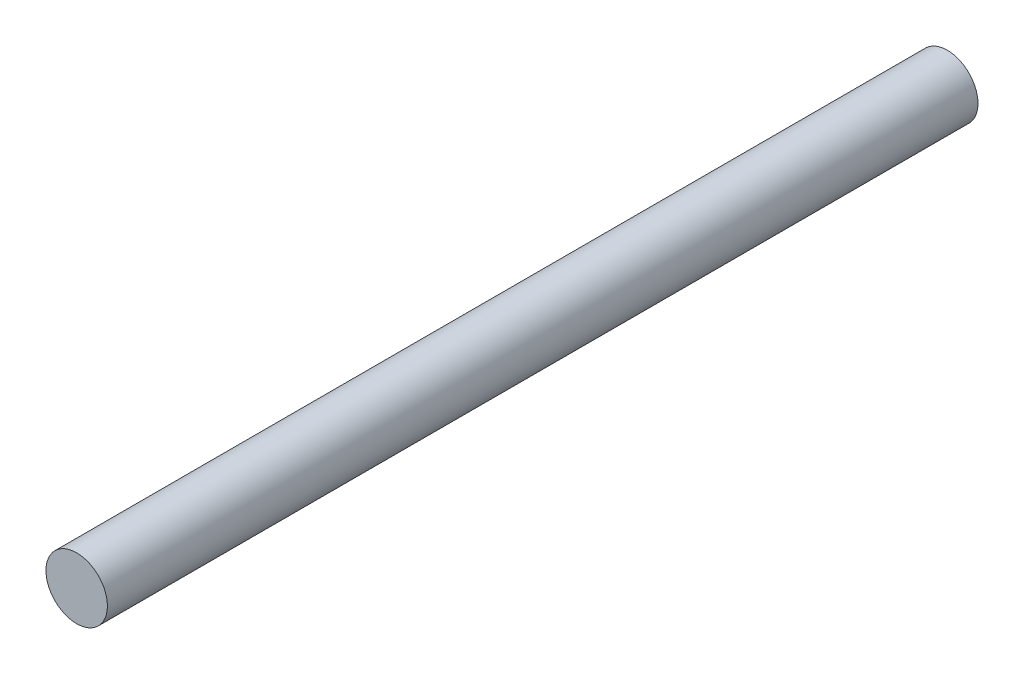
ISO-10303-21;
HEADER;
FILE_DESCRIPTION(('STEP AP214'),'2;1');
FILE_NAME('part.step','',(''),(''),'','','');
FILE_SCHEMA(('AUTOMOTIVE_DESIGN { 1 0 10303 214 1 1 1 1 }'));
ENDSEC;
DATA;
#1=APPLICATION_CONTEXT('core data for automotive mechanical design processes');
#2=APPLICATION_PROTOCOL_DEFINITION('international standard','automotive_design',2000,#1);
#3=PRODUCT_CONTEXT('',#1,'mechanical');
#4=PRODUCT('Part','Part','',(#3));
#5=PRODUCT_RELATED_PRODUCT_CATEGORY('part','',(#4));
#6=PRODUCT_DEFINITION_FORMATION('','',#4);
#7=PRODUCT_DEFINITION_CONTEXT('part definition',#1,'design');
#8=PRODUCT_DEFINITION('design','',#6,#7);
#9=PRODUCT_DEFINITION_SHAPE('','',#8);
#10=(LENGTH_UNIT() NAMED_UNIT(*) SI_UNIT(.MILLI.,.METRE.));
#11=(NAMED_UNIT(*) PLANE_ANGLE_UNIT() SI_UNIT($,.RADIAN.));
#12=(NAMED_UNIT(*) SI_UNIT($,.STERADIAN.) SOLID_ANGLE_UNIT());
#13=UNCERTAINTY_MEASURE_WITH_UNIT(LENGTH_MEASURE(1.E-05),#10,'distance_accuracy_value','');
#14=(GEOMETRIC_REPRESENTATION_CONTEXT(3) GLOBAL_UNCERTAINTY_ASSIGNED_CONTEXT((#13)) GLOBAL_UNIT_ASSIGNED_CONTEXT((#10,
#11,#12)) REPRESENTATION_CONTEXT('',''));
#15=CARTESIAN_POINT('',(0.,0.,0.));
#16=DIRECTION('',(0.,0.,1.));
#17=DIRECTION('',(1.,0.,0.));
#18=AXIS2_PLACEMENT_3D('',#15,#16,#17);
#19=CARTESIAN_POINT('',(0.,0.,170.));
#20=DIRECTION('',(0.,0.,-1.));
#21=DIRECTION('',(-1.,0.,0.));
#22=AXIS2_PLACEMENT_3D('',#19,#20,#21);
#23=CYLINDRICAL_SURFACE('',#22,6.);
#24=CARTESIAN_POINT('',(0.,0.,170.));
#25=DIRECTION('',(0.,0.,1.));
#26=DIRECTION('',(1.,0.,0.));
#27=AXIS2_PLACEMENT_3D('',#24,#25,#26);
#28=CIRCLE('',#27,6.);
#29=CARTESIAN_POINT('',(6.,0.,170.));
#30=VERTEX_POINT('',#29);
#31=EDGE_CURVE('E10',#30,#30,#28,.T.);
#32=ORIENTED_EDGE('',*,*,#31,.F.);
#33=EDGE_LOOP('',(#32));
#34=FACE_BOUND('',#33,.T.);
#35=CARTESIAN_POINT('',(0.,0.,0.));
#36=DIRECTION('',(0.,0.,1.));
#37=DIRECTION('',(1.,0.,0.));
#38=AXIS2_PLACEMENT_3D('',#35,#36,#37);
#39=CIRCLE('',#38,6.);
#40=CARTESIAN_POINT('',(6.,0.,0.));
#41=VERTEX_POINT('',#40);
#42=EDGE_CURVE('E35',#41,#41,#39,.T.);
#43=ORIENTED_EDGE('',*,*,#42,.T.);
#44=EDGE_LOOP('',(#43));
#45=FACE_BOUND('',#44,.T.);
#46=ADVANCED_FACE('F32',(#34,#45),#23,.T.);
#47=CARTESIAN_POINT('',(0.,0.,170.));
#48=DIRECTION('',(0.,0.,1.));
#49=DIRECTION('',(1.,0.,0.));
#50=AXIS2_PLACEMENT_3D('',#47,#48,#49);
#51=PLANE('',#50);
#52=ORIENTED_EDGE('',*,*,#31,.T.);
#53=EDGE_LOOP('',(#52));
#54=FACE_BOUND('',#53,.T.);
#55=ADVANCED_FACE('F47',(#54),#51,.T.);
#56=CARTESIAN_POINT('',(0.,0.,0.));
#57=DIRECTION('',(0.,0.,1.));
#58=DIRECTION('',(1.,0.,0.));
#59=AXIS2_PLACEMENT_3D('',#56,#57,#58);
#60=PLANE('',#59);
#61=ORIENTED_EDGE('',*,*,#42,.F.);
#62=EDGE_LOOP('',(#61));
#63=FACE_BOUND('',#62,.T.);
#64=ADVANCED_FACE('F45',(#63),#60,.F.);
#65=CLOSED_SHELL('',(#46,#55,#64));
#66=MANIFOLD_SOLID_BREP('B2',#65);
#67=ADVANCED_BREP_SHAPE_REPRESENTATION('',(#18,#66),#14);
#68=SHAPE_DEFINITION_REPRESENTATION(#9,#67);
ENDSEC;
END-ISO-10303-21;
